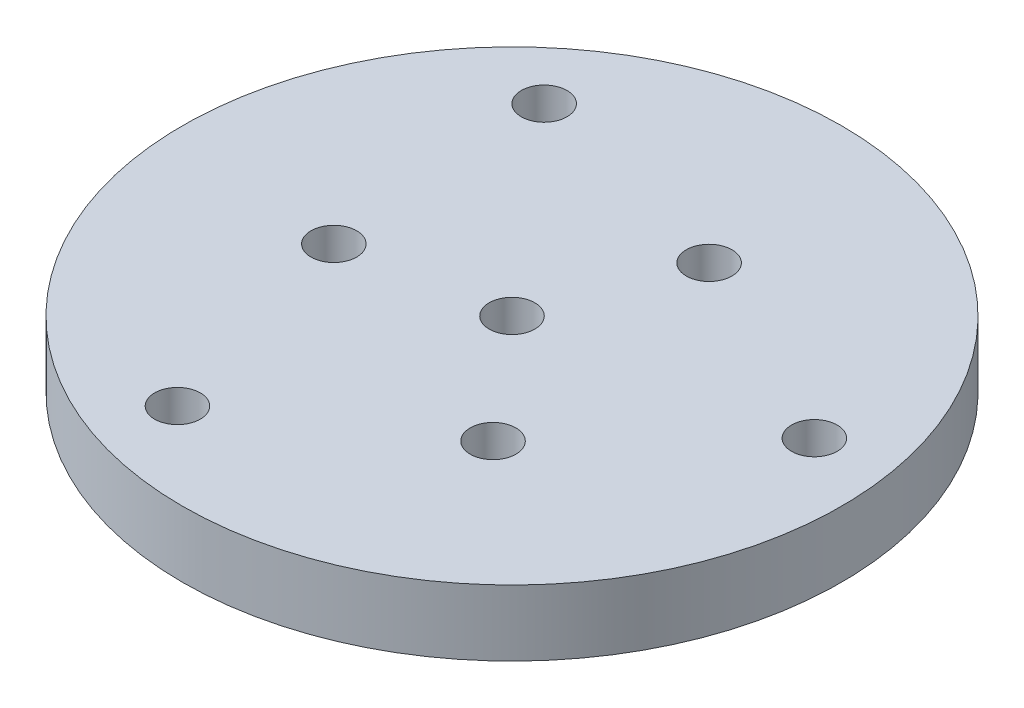
ISO-10303-21;
HEADER;
FILE_DESCRIPTION(('STEP AP214'),'2;1');
FILE_NAME('part.step','',(''),(''),'','','');
FILE_SCHEMA(('AUTOMOTIVE_DESIGN { 1 0 10303 214 1 1 1 1 }'));
ENDSEC;
DATA;
#1=APPLICATION_CONTEXT('core data for automotive mechanical design processes');
#2=APPLICATION_PROTOCOL_DEFINITION('international standard','automotive_design',2000,#1);
#3=PRODUCT_CONTEXT('',#1,'mechanical');
#4=PRODUCT('Part','Part','',(#3));
#5=PRODUCT_RELATED_PRODUCT_CATEGORY('part','',(#4));
#6=PRODUCT_DEFINITION_FORMATION('','',#4);
#7=PRODUCT_DEFINITION_CONTEXT('part definition',#1,'design');
#8=PRODUCT_DEFINITION('design','',#6,#7);
#9=PRODUCT_DEFINITION_SHAPE('','',#8);
#10=(LENGTH_UNIT() NAMED_UNIT(*) SI_UNIT(.MILLI.,.METRE.));
#11=(NAMED_UNIT(*) PLANE_ANGLE_UNIT() SI_UNIT($,.RADIAN.));
#12=(NAMED_UNIT(*) SI_UNIT($,.STERADIAN.) SOLID_ANGLE_UNIT());
#13=UNCERTAINTY_MEASURE_WITH_UNIT(LENGTH_MEASURE(1.E-05),#10,'distance_accuracy_value','');
#14=(GEOMETRIC_REPRESENTATION_CONTEXT(3) GLOBAL_UNCERTAINTY_ASSIGNED_CONTEXT((#13)) GLOBAL_UNIT_ASSIGNED_CONTEXT((#10,
#11,#12)) REPRESENTATION_CONTEXT('',''));
#15=CARTESIAN_POINT('',(0.,0.,0.));
#16=DIRECTION('',(0.,0.,1.));
#17=DIRECTION('',(1.,0.,0.));
#18=AXIS2_PLACEMENT_3D('',#15,#16,#17);
#19=CARTESIAN_POINT('',(0.,4.7625,0.));
#20=DIRECTION('',(0.,1.,0.));
#21=DIRECTION('',(0.,0.,1.));
#22=AXIS2_PLACEMENT_3D('',#19,#20,#21);
#23=PLANE('',#22);
#24=CARTESIAN_POINT('',(-12.9006577861007,4.7625,35.4442659634238));
#25=DIRECTION('',(0.,1.,0.));
#26=DIRECTION('',(0.,0.,1.));
#27=AXIS2_PLACEMENT_3D('',#24,#25,#26);
#28=CIRCLE('',#27,3.3);
#29=CARTESIAN_POINT('',(-12.9006577861007,4.7625,38.7442659634238));
#30=VERTEX_POINT('',#29);
#31=EDGE_CURVE('E67',#30,#30,#28,.T.);
#32=ORIENTED_EDGE('',*,*,#31,.F.);
#33=EDGE_LOOP('',(#32));
#34=FACE_BOUND('',#33,.T.);
#35=CARTESIAN_POINT('',(7.60139768541295,4.7625,-20.8846684969668));
#36=DIRECTION('',(0.,1.,0.));
#37=DIRECTION('',(0.,0.,1.));
#38=AXIS2_PLACEMENT_3D('',#35,#36,#37);
#39=CIRCLE('',#38,3.3);
#40=CARTESIAN_POINT('',(7.60139768541295,4.7625,-17.5846684969668));
#41=VERTEX_POINT('',#40);
#42=EDGE_CURVE('E72',#41,#41,#39,.T.);
#43=ORIENTED_EDGE('',*,*,#42,.F.);
#44=EDGE_LOOP('',(#43));
#45=FACE_BOUND('',#44,.T.);
#46=CARTESIAN_POINT('',(14.2859546252834,4.7625,17.0253377483193));
#47=DIRECTION('',(0.,1.,0.));
#48=DIRECTION('',(0.,0.,1.));
#49=AXIS2_PLACEMENT_3D('',#46,#47,#48);
#50=CIRCLE('',#49,3.3);
#51=CARTESIAN_POINT('',(14.2859546252834,4.7625,20.3253377483193));
#52=VERTEX_POINT('',#51);
#53=EDGE_CURVE('E64',#52,#52,#50,.T.);
#54=ORIENTED_EDGE('',*,*,#53,.F.);
#55=EDGE_LOOP('',(#54));
#56=FACE_BOUND('',#55,.T.);
#57=CARTESIAN_POINT('',(-24.2453058497666,4.7625,-28.8944303500047));
#58=DIRECTION('',(0.,1.,0.));
#59=DIRECTION('',(0.,0.,1.));
#60=AXIS2_PLACEMENT_3D('',#57,#58,#59);
#61=CIRCLE('',#60,3.3);
#62=CARTESIAN_POINT('',(-24.2453058497666,4.7625,-25.5944303500047));
#63=VERTEX_POINT('',#62);
#64=EDGE_CURVE('E57',#63,#63,#61,.T.);
#65=ORIENTED_EDGE('',*,*,#64,.F.);
#66=EDGE_LOOP('',(#65));
#67=FACE_BOUND('',#66,.T.);
#68=CARTESIAN_POINT('',(37.1459636358675,4.7625,-6.54983561341885));
#69=DIRECTION('',(0.,1.,0.));
#70=DIRECTION('',(0.,0.,1.));
#71=AXIS2_PLACEMENT_3D('',#68,#69,#70);
#72=CIRCLE('',#71,3.3);
#73=CARTESIAN_POINT('',(37.1459636358675,4.7625,-3.24983561341885));
#74=VERTEX_POINT('',#73);
#75=EDGE_CURVE('E58',#74,#74,#72,.T.);
#76=ORIENTED_EDGE('',*,*,#75,.F.);
#77=EDGE_LOOP('',(#76));
#78=FACE_BOUND('',#77,.T.);
#79=CARTESIAN_POINT('',(-21.8873523106963,4.7625,3.85933074864756));
#80=DIRECTION('',(0.,1.,0.));
#81=DIRECTION('',(0.,0.,1.));
#82=AXIS2_PLACEMENT_3D('',#79,#80,#81);
#83=CIRCLE('',#82,3.3);
#84=CARTESIAN_POINT('',(-21.8873523106963,4.7625,7.15933074864756));
#85=VERTEX_POINT('',#84);
#86=EDGE_CURVE('E71',#85,#85,#83,.T.);
#87=ORIENTED_EDGE('',*,*,#86,.F.);
#88=EDGE_LOOP('',(#87));
#89=FACE_BOUND('',#88,.T.);
#90=CARTESIAN_POINT('',(0.,4.7625,0.));
#91=DIRECTION('',(0.,1.,0.));
#92=DIRECTION('',(0.,0.,1.));
#93=AXIS2_PLACEMENT_3D('',#90,#91,#92);
#94=CIRCLE('',#93,47.625);
#95=CARTESIAN_POINT('',(0.,4.7625,47.625));
#96=VERTEX_POINT('',#95);
#97=EDGE_CURVE('E10',#96,#96,#94,.T.);
#98=ORIENTED_EDGE('',*,*,#97,.T.);
#99=EDGE_LOOP('',(#98));
#100=FACE_BOUND('',#99,.T.);
#101=CARTESIAN_POINT('',(0.,4.7625,0.));
#102=DIRECTION('',(0.,1.,0.));
#103=DIRECTION('',(0.,0.,1.));
#104=AXIS2_PLACEMENT_3D('',#101,#102,#103);
#105=CIRCLE('',#104,3.3);
#106=CARTESIAN_POINT('',(0.,4.7625,3.3));
#107=VERTEX_POINT('',#106);
#108=EDGE_CURVE('E46',#107,#107,#105,.T.);
#109=ORIENTED_EDGE('',*,*,#108,.F.);
#110=EDGE_LOOP('',(#109));
#111=FACE_BOUND('',#110,.T.);
#112=ADVANCED_FACE('F35',(#34,#45,#56,#67,#78,#89,#100,#111),#23,.T.);
#113=CARTESIAN_POINT('',(0.,-4.7625,0.));
#114=DIRECTION('',(0.,1.,0.));
#115=DIRECTION('',(0.,0.,1.));
#116=AXIS2_PLACEMENT_3D('',#113,#114,#115);
#117=PLANE('',#116);
#118=CARTESIAN_POINT('',(-12.9006577861007,-4.7625,35.4442659634238));
#119=DIRECTION('',(0.,1.,0.));
#120=DIRECTION('',(0.,0.,1.));
#121=AXIS2_PLACEMENT_3D('',#118,#119,#120);
#122=CIRCLE('',#121,3.3);
#123=CARTESIAN_POINT('',(-12.9006577861007,-4.7625,38.7442659634238));
#124=VERTEX_POINT('',#123);
#125=EDGE_CURVE('E51',#124,#124,#122,.T.);
#126=ORIENTED_EDGE('',*,*,#125,.T.);
#127=EDGE_LOOP('',(#126));
#128=FACE_BOUND('',#127,.T.);
#129=CARTESIAN_POINT('',(7.60139768541295,-4.7625,-20.8846684969668));
#130=DIRECTION('',(0.,1.,0.));
#131=DIRECTION('',(0.,0.,1.));
#132=AXIS2_PLACEMENT_3D('',#129,#130,#131);
#133=CIRCLE('',#132,3.3);
#134=CARTESIAN_POINT('',(7.60139768541295,-4.7625,-17.5846684969668));
#135=VERTEX_POINT('',#134);
#136=EDGE_CURVE('E80',#135,#135,#133,.T.);
#137=ORIENTED_EDGE('',*,*,#136,.T.);
#138=EDGE_LOOP('',(#137));
#139=FACE_BOUND('',#138,.T.);
#140=CARTESIAN_POINT('',(14.2859546252834,-4.7625,17.0253377483193));
#141=DIRECTION('',(0.,1.,0.));
#142=DIRECTION('',(0.,0.,1.));
#143=AXIS2_PLACEMENT_3D('',#140,#141,#142);
#144=CIRCLE('',#143,3.3);
#145=CARTESIAN_POINT('',(14.2859546252834,-4.7625,20.3253377483193));
#146=VERTEX_POINT('',#145);
#147=EDGE_CURVE('E61',#146,#146,#144,.T.);
#148=ORIENTED_EDGE('',*,*,#147,.T.);
#149=EDGE_LOOP('',(#148));
#150=FACE_BOUND('',#149,.T.);
#151=CARTESIAN_POINT('',(-24.2453058497666,-4.7625,-28.8944303500047));
#152=DIRECTION('',(0.,1.,0.));
#153=DIRECTION('',(0.,0.,1.));
#154=AXIS2_PLACEMENT_3D('',#151,#152,#153);
#155=CIRCLE('',#154,3.3);
#156=CARTESIAN_POINT('',(-24.2453058497666,-4.7625,-25.5944303500047));
#157=VERTEX_POINT('',#156);
#158=EDGE_CURVE('E54',#157,#157,#155,.T.);
#159=ORIENTED_EDGE('',*,*,#158,.T.);
#160=EDGE_LOOP('',(#159));
#161=FACE_BOUND('',#160,.T.);
#162=CARTESIAN_POINT('',(37.1459636358675,-4.7625,-6.54983561341885));
#163=DIRECTION('',(0.,1.,0.));
#164=DIRECTION('',(0.,0.,1.));
#165=AXIS2_PLACEMENT_3D('',#162,#163,#164);
#166=CIRCLE('',#165,3.3);
#167=CARTESIAN_POINT('',(37.1459636358675,-4.7625,-3.24983561341885));
#168=VERTEX_POINT('',#167);
#169=EDGE_CURVE('E75',#168,#168,#166,.T.);
#170=ORIENTED_EDGE('',*,*,#169,.T.);
#171=EDGE_LOOP('',(#170));
#172=FACE_BOUND('',#171,.T.);
#173=CARTESIAN_POINT('',(-21.8873523106963,-4.7625,3.85933074864756));
#174=DIRECTION('',(0.,1.,0.));
#175=DIRECTION('',(0.,0.,1.));
#176=AXIS2_PLACEMENT_3D('',#173,#174,#175);
#177=CIRCLE('',#176,3.3);
#178=CARTESIAN_POINT('',(-21.8873523106963,-4.7625,7.15933074864756));
#179=VERTEX_POINT('',#178);
#180=EDGE_CURVE('E68',#179,#179,#177,.T.);
#181=ORIENTED_EDGE('',*,*,#180,.T.);
#182=EDGE_LOOP('',(#181));
#183=FACE_BOUND('',#182,.T.);
#184=CARTESIAN_POINT('',(0.,-4.7625,0.));
#185=DIRECTION('',(0.,1.,0.));
#186=DIRECTION('',(0.,0.,1.));
#187=AXIS2_PLACEMENT_3D('',#184,#185,#186);
#188=CIRCLE('',#187,47.625);
#189=CARTESIAN_POINT('',(0.,-4.7625,47.625));
#190=VERTEX_POINT('',#189);
#191=EDGE_CURVE('E39',#190,#190,#188,.T.);
#192=ORIENTED_EDGE('',*,*,#191,.F.);
#193=EDGE_LOOP('',(#192));
#194=FACE_BOUND('',#193,.T.);
#195=CARTESIAN_POINT('',(0.,-4.7625,0.));
#196=DIRECTION('',(0.,1.,0.));
#197=DIRECTION('',(0.,0.,1.));
#198=AXIS2_PLACEMENT_3D('',#195,#196,#197);
#199=CIRCLE('',#198,3.3);
#200=CARTESIAN_POINT('',(0.,-4.7625,3.3));
#201=VERTEX_POINT('',#200);
#202=EDGE_CURVE('E48',#201,#201,#199,.T.);
#203=ORIENTED_EDGE('',*,*,#202,.T.);
#204=EDGE_LOOP('',(#203));
#205=FACE_BOUND('',#204,.T.);
#206=ADVANCED_FACE('F90',(#128,#139,#150,#161,#172,#183,#194,#205),#117,.F.);
#207=CARTESIAN_POINT('',(0.,4.7625,0.));
#208=DIRECTION('',(0.,-1.,0.));
#209=DIRECTION('',(0.,0.,-1.));
#210=AXIS2_PLACEMENT_3D('',#207,#208,#209);
#211=CYLINDRICAL_SURFACE('',#210,47.625);
#212=ORIENTED_EDGE('',*,*,#97,.F.);
#213=EDGE_LOOP('',(#212));
#214=FACE_BOUND('',#213,.T.);
#215=ORIENTED_EDGE('',*,*,#191,.T.);
#216=EDGE_LOOP('',(#215));
#217=FACE_BOUND('',#216,.T.);
#218=ADVANCED_FACE('F37',(#214,#217),#211,.T.);
#219=CARTESIAN_POINT('',(0.,4.7625,0.));
#220=DIRECTION('',(0.,-1.,0.));
#221=DIRECTION('',(0.,0.,-1.));
#222=AXIS2_PLACEMENT_3D('',#219,#220,#221);
#223=CYLINDRICAL_SURFACE('',#222,3.3);
#224=ORIENTED_EDGE('',*,*,#108,.T.);
#225=EDGE_LOOP('',(#224));
#226=FACE_BOUND('',#225,.T.);
#227=ORIENTED_EDGE('',*,*,#202,.F.);
#228=EDGE_LOOP('',(#227));
#229=FACE_BOUND('',#228,.T.);
#230=ADVANCED_FACE('F115',(#226,#229),#223,.F.);
#231=CARTESIAN_POINT('',(-21.8873523106963,-4.7625,3.85933074864756));
#232=DIRECTION('',(0.,1.,0.));
#233=DIRECTION('',(0.,0.,1.));
#234=AXIS2_PLACEMENT_3D('',#231,#232,#233);
#235=CYLINDRICAL_SURFACE('',#234,3.3);
#236=ORIENTED_EDGE('',*,*,#180,.F.);
#237=EDGE_LOOP('',(#236));
#238=FACE_BOUND('',#237,.T.);
#239=ORIENTED_EDGE('',*,*,#86,.T.);
#240=EDGE_LOOP('',(#239));
#241=FACE_BOUND('',#240,.T.);
#242=ADVANCED_FACE('F118',(#238,#241),#235,.F.);
#243=CARTESIAN_POINT('',(37.1459636358675,-4.7625,-6.54983561341885));
#244=DIRECTION('',(0.,1.,0.));
#245=DIRECTION('',(0.,0.,1.));
#246=AXIS2_PLACEMENT_3D('',#243,#244,#245);
#247=CYLINDRICAL_SURFACE('',#246,3.3);
#248=ORIENTED_EDGE('',*,*,#169,.F.);
#249=EDGE_LOOP('',(#248));
#250=FACE_BOUND('',#249,.T.);
#251=ORIENTED_EDGE('',*,*,#75,.T.);
#252=EDGE_LOOP('',(#251));
#253=FACE_BOUND('',#252,.T.);
#254=ADVANCED_FACE('F132',(#250,#253),#247,.F.);
#255=CARTESIAN_POINT('',(-24.2453058497666,-4.7625,-28.8944303500047));
#256=DIRECTION('',(0.,1.,0.));
#257=DIRECTION('',(0.,0.,1.));
#258=AXIS2_PLACEMENT_3D('',#255,#256,#257);
#259=CYLINDRICAL_SURFACE('',#258,3.3);
#260=ORIENTED_EDGE('',*,*,#158,.F.);
#261=EDGE_LOOP('',(#260));
#262=FACE_BOUND('',#261,.T.);
#263=ORIENTED_EDGE('',*,*,#64,.T.);
#264=EDGE_LOOP('',(#263));
#265=FACE_BOUND('',#264,.T.);
#266=ADVANCED_FACE('F128',(#262,#265),#259,.F.);
#267=CARTESIAN_POINT('',(14.2859546252834,-4.7625,17.0253377483193));
#268=DIRECTION('',(0.,1.,0.));
#269=DIRECTION('',(0.,0.,1.));
#270=AXIS2_PLACEMENT_3D('',#267,#268,#269);
#271=CYLINDRICAL_SURFACE('',#270,3.3);
#272=ORIENTED_EDGE('',*,*,#147,.F.);
#273=EDGE_LOOP('',(#272));
#274=FACE_BOUND('',#273,.T.);
#275=ORIENTED_EDGE('',*,*,#53,.T.);
#276=EDGE_LOOP('',(#275));
#277=FACE_BOUND('',#276,.T.);
#278=ADVANCED_FACE('F131',(#274,#277),#271,.F.);
#279=CARTESIAN_POINT('',(7.60139768541295,-4.7625,-20.8846684969668));
#280=DIRECTION('',(0.,1.,0.));
#281=DIRECTION('',(0.,0.,1.));
#282=AXIS2_PLACEMENT_3D('',#279,#280,#281);
#283=CYLINDRICAL_SURFACE('',#282,3.3);
#284=ORIENTED_EDGE('',*,*,#136,.F.);
#285=EDGE_LOOP('',(#284));
#286=FACE_BOUND('',#285,.T.);
#287=ORIENTED_EDGE('',*,*,#42,.T.);
#288=EDGE_LOOP('',(#287));
#289=FACE_BOUND('',#288,.T.);
#290=ADVANCED_FACE('F96',(#286,#289),#283,.F.);
#291=CARTESIAN_POINT('',(-12.9006577861007,-4.7625,35.4442659634238));
#292=DIRECTION('',(0.,1.,0.));
#293=DIRECTION('',(0.,0.,1.));
#294=AXIS2_PLACEMENT_3D('',#291,#292,#293);
#295=CYLINDRICAL_SURFACE('',#294,3.3);
#296=ORIENTED_EDGE('',*,*,#125,.F.);
#297=EDGE_LOOP('',(#296));
#298=FACE_BOUND('',#297,.T.);
#299=ORIENTED_EDGE('',*,*,#31,.T.);
#300=EDGE_LOOP('',(#299));
#301=FACE_BOUND('',#300,.T.);
#302=ADVANCED_FACE('F93',(#298,#301),#295,.F.);
#303=CLOSED_SHELL('',(#112,#206,#218,#230,#242,#254,#266,#278,#290,#302));
#304=MANIFOLD_SOLID_BREP('B2',#303);
#305=ADVANCED_BREP_SHAPE_REPRESENTATION('',(#18,#304),#14);
#306=SHAPE_DEFINITION_REPRESENTATION(#9,#305);
ENDSEC;
END-ISO-10303-21;
